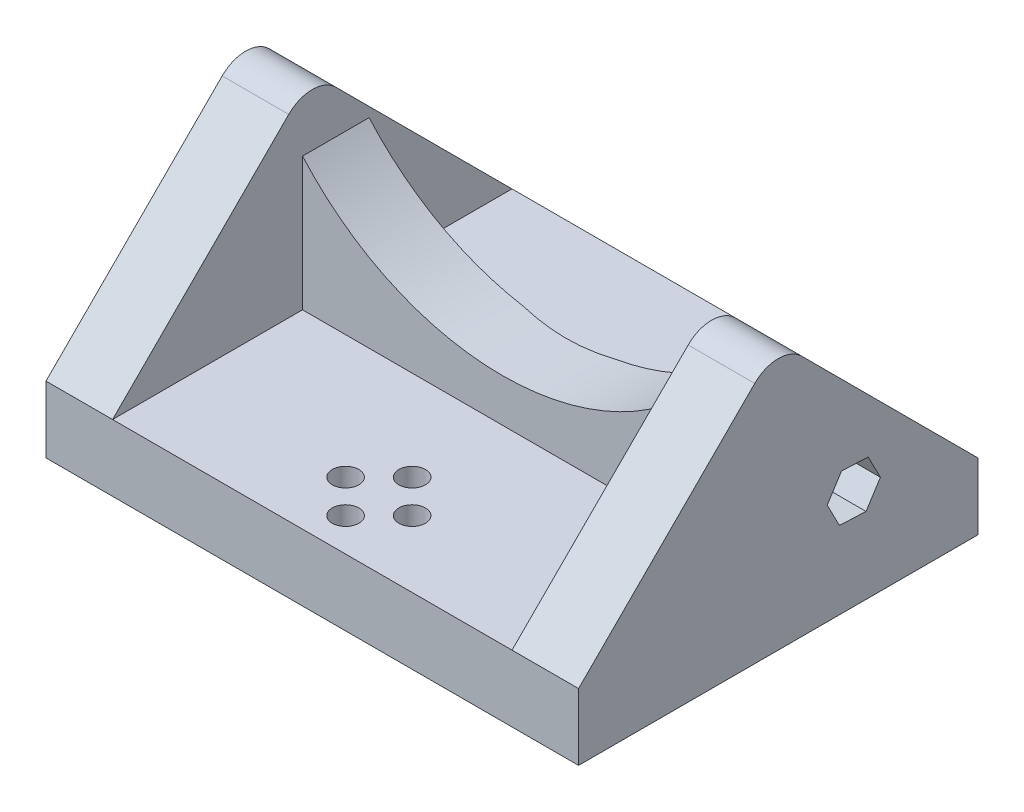
ISO-10303-21;
HEADER;
FILE_DESCRIPTION(('STEP AP214'),'2;1');
FILE_NAME('part.step','',(''),(''),'','','');
FILE_SCHEMA(('AUTOMOTIVE_DESIGN { 1 0 10303 214 1 1 1 1 }'));
ENDSEC;
DATA;
#1=APPLICATION_CONTEXT('core data for automotive mechanical design processes');
#2=APPLICATION_PROTOCOL_DEFINITION('international standard','automotive_design',2000,#1);
#3=PRODUCT_CONTEXT('',#1,'mechanical');
#4=PRODUCT('Part','Part','',(#3));
#5=PRODUCT_RELATED_PRODUCT_CATEGORY('part','',(#4));
#6=PRODUCT_DEFINITION_FORMATION('','',#4);
#7=PRODUCT_DEFINITION_CONTEXT('part definition',#1,'design');
#8=PRODUCT_DEFINITION('design','',#6,#7);
#9=PRODUCT_DEFINITION_SHAPE('','',#8);
#10=(LENGTH_UNIT() NAMED_UNIT(*) SI_UNIT(.MILLI.,.METRE.));
#11=(NAMED_UNIT(*) PLANE_ANGLE_UNIT() SI_UNIT($,.RADIAN.));
#12=(NAMED_UNIT(*) SI_UNIT($,.STERADIAN.) SOLID_ANGLE_UNIT());
#13=UNCERTAINTY_MEASURE_WITH_UNIT(LENGTH_MEASURE(1.E-05),#10,'distance_accuracy_value','');
#14=(GEOMETRIC_REPRESENTATION_CONTEXT(3) GLOBAL_UNCERTAINTY_ASSIGNED_CONTEXT((#13)) GLOBAL_UNIT_ASSIGNED_CONTEXT((#10,
#11,#12)) REPRESENTATION_CONTEXT('',''));
#15=CARTESIAN_POINT('',(0.,0.,0.));
#16=DIRECTION('',(0.,0.,1.));
#17=DIRECTION('',(1.,0.,0.));
#18=AXIS2_PLACEMENT_3D('',#15,#16,#17);
#19=CARTESIAN_POINT('',(-40.,56.4575131106459,-38.5355339059327));
#20=DIRECTION('',(0.,0.,1.));
#21=DIRECTION('',(1.,0.,0.));
#22=AXIS2_PLACEMENT_3D('',#19,#20,#21);
#23=PLANE('',#22);
#24=DIRECTION('',(0.,-1.,0.));
#25=VECTOR('',#24,1.);
#26=CARTESIAN_POINT('',(-70.,30.,-38.5355339059327));
#27=LINE('',#26,#25);
#28=CARTESIAN_POINT('',(-70.,12.8888136877048,-38.5355339059327));
#29=VERTEX_POINT('',#28);
#30=CARTESIAN_POINT('',(-70.,10.,-38.5355339059327));
#31=VERTEX_POINT('',#30);
#32=EDGE_CURVE('E392',#29,#31,#27,.T.);
#33=ORIENTED_EDGE('',*,*,#32,.F.);
#34=DIRECTION('',(1.,0.,0.));
#35=VECTOR('',#34,1.);
#36=CARTESIAN_POINT('',(-40.,12.8888136877048,-38.5355339059327));
#37=LINE('',#36,#35);
#38=CARTESIAN_POINT('',(-10.,12.8888136877048,-38.5355339059327));
#39=VERTEX_POINT('',#38);
#40=EDGE_CURVE('E527',#29,#39,#37,.T.);
#41=ORIENTED_EDGE('',*,*,#40,.T.);
#42=DIRECTION('',(0.,1.,0.));
#43=VECTOR('',#42,1.);
#44=CARTESIAN_POINT('',(-10.,10.,-38.5355339059327));
#45=LINE('',#44,#43);
#46=CARTESIAN_POINT('',(-10.,10.,-38.5355339059327));
#47=VERTEX_POINT('',#46);
#48=EDGE_CURVE('E375',#47,#39,#45,.T.);
#49=ORIENTED_EDGE('',*,*,#48,.F.);
#50=DIRECTION('',(1.,0.,0.));
#51=VECTOR('',#50,1.);
#52=CARTESIAN_POINT('',(-70.,10.,-38.5355339059327));
#53=LINE('',#52,#51);
#54=EDGE_CURVE('E397',#31,#47,#53,.T.);
#55=ORIENTED_EDGE('',*,*,#54,.F.);
#56=EDGE_LOOP('',(#33,#41,#49,#55));
#57=FACE_BOUND('',#56,.T.);
#58=ADVANCED_FACE('F39',(#57),#23,.F.);
#59=CARTESIAN_POINT('',(-10.,17.0398730154495,-38.5355339059327));
#60=VERTEX_POINT('',#59);
#61=CARTESIAN_POINT('',(-10.,30.,-38.5355339059327));
#62=VERTEX_POINT('',#61);
#63=EDGE_CURVE('E400',#60,#62,#45,.T.);
#64=ORIENTED_EDGE('',*,*,#63,.F.);
#65=DIRECTION('',(-1.,0.,0.));
#66=VECTOR('',#65,1.);
#67=CARTESIAN_POINT('',(-40.,17.0398730154495,-38.5355339059327));
#68=LINE('',#67,#66);
#69=CARTESIAN_POINT('',(-33.1992905277785,17.0398730154495,-38.5355339059327));
#70=VERTEX_POINT('',#69);
#71=EDGE_CURVE('E526',#60,#70,#68,.T.);
#72=ORIENTED_EDGE('',*,*,#71,.T.);
#73=CARTESIAN_POINT('',(-40.,56.4575131106459,-38.5355339059327));
#74=DIRECTION('',(0.,0.,-1.));
#75=DIRECTION('',(1.,0.,0.));
#76=AXIS2_PLACEMENT_3D('',#73,#74,#75);
#77=CIRCLE('',#76,40.);
#78=EDGE_CURVE('E388',#62,#70,#77,.T.);
#79=ORIENTED_EDGE('',*,*,#78,.F.);
#80=EDGE_LOOP('',(#64,#72,#79));
#81=FACE_BOUND('',#80,.T.);
#82=ADVANCED_FACE('F568',(#81),#23,.F.);
#83=CARTESIAN_POINT('',(0.,10.,0.));
#84=DIRECTION('',(0.,1.,0.));
#85=DIRECTION('',(0.,0.,1.));
#86=AXIS2_PLACEMENT_3D('',#83,#84,#85);
#87=PLANE('',#86);
#88=DIRECTION('',(0.,0.,-1.));
#89=VECTOR('',#88,1.);
#90=CARTESIAN_POINT('',(-70.,10.,-60.));
#91=LINE('',#90,#89);
#92=CARTESIAN_POINT('',(-70.,10.,-60.));
#93=VERTEX_POINT('',#92);
#94=EDGE_CURVE('E411',#31,#93,#91,.T.);
#95=ORIENTED_EDGE('',*,*,#94,.F.);
#96=ORIENTED_EDGE('',*,*,#54,.T.);
#97=DIRECTION('',(0.,0.,-1.));
#98=VECTOR('',#97,1.);
#99=CARTESIAN_POINT('',(-10.,10.,-60.));
#100=LINE('',#99,#98);
#101=CARTESIAN_POINT('',(-10.,10.,-60.));
#102=VERTEX_POINT('',#101);
#103=EDGE_CURVE('E440',#47,#102,#100,.T.);
#104=ORIENTED_EDGE('',*,*,#103,.T.);
#105=DIRECTION('',(-1.,0.,0.));
#106=VECTOR('',#105,1.);
#107=CARTESIAN_POINT('',(0.,10.,-60.));
#108=LINE('',#107,#106);
#109=EDGE_CURVE('E463',#102,#93,#108,.T.);
#110=ORIENTED_EDGE('',*,*,#109,.T.);
#111=EDGE_LOOP('',(#95,#96,#104,#110));
#112=FACE_BOUND('',#111,.T.);
#113=ADVANCED_FACE('F575',(#112),#87,.T.);
#114=CARTESIAN_POINT('',(-40.,10.,-15.));
#115=DIRECTION('',(0.,1.,0.));
#116=DIRECTION('',(0.,0.,1.));
#117=AXIS2_PLACEMENT_3D('',#114,#115,#116);
#118=CIRCLE('',#117,2.);
#119=CARTESIAN_POINT('',(-40.,10.,-13.));
#120=VERTEX_POINT('',#119);
#121=EDGE_CURVE('E343',#120,#120,#118,.T.);
#122=ORIENTED_EDGE('',*,*,#121,.F.);
#123=EDGE_LOOP('',(#122));
#124=FACE_BOUND('',#123,.T.);
#125=CARTESIAN_POINT('',(-34.9999999999999,10.,-10.0000000000001));
#126=DIRECTION('',(0.,1.,0.));
#127=DIRECTION('',(0.,0.,1.));
#128=AXIS2_PLACEMENT_3D('',#125,#126,#127);
#129=CIRCLE('',#128,2.);
#130=CARTESIAN_POINT('',(-34.9999999999999,10.,-8.00000000000011));
#131=VERTEX_POINT('',#130);
#132=EDGE_CURVE('E351',#131,#131,#129,.T.);
#133=ORIENTED_EDGE('',*,*,#132,.F.);
#134=EDGE_LOOP('',(#133));
#135=FACE_BOUND('',#134,.T.);
#136=CARTESIAN_POINT('',(-39.9999999999998,10.,-5.));
#137=DIRECTION('',(0.,1.,0.));
#138=DIRECTION('',(0.,0.,1.));
#139=AXIS2_PLACEMENT_3D('',#136,#137,#138);
#140=CIRCLE('',#139,2.00000000000001);
#141=CARTESIAN_POINT('',(-39.9999999999998,10.,-2.99999999999999));
#142=VERTEX_POINT('',#141);
#143=EDGE_CURVE('E359',#142,#142,#140,.T.);
#144=ORIENTED_EDGE('',*,*,#143,.F.);
#145=EDGE_LOOP('',(#144));
#146=FACE_BOUND('',#145,.T.);
#147=CARTESIAN_POINT('',(-44.9999999999999,10.,-9.99999999999991));
#148=DIRECTION('',(0.,1.,0.));
#149=DIRECTION('',(0.,0.,1.));
#150=AXIS2_PLACEMENT_3D('',#147,#148,#149);
#151=CIRCLE('',#150,2.);
#152=CARTESIAN_POINT('',(-44.9999999999999,10.,-7.99999999999991));
#153=VERTEX_POINT('',#152);
#154=EDGE_CURVE('E337',#153,#153,#151,.T.);
#155=ORIENTED_EDGE('',*,*,#154,.F.);
#156=EDGE_LOOP('',(#155));
#157=FACE_BOUND('',#156,.T.);
#158=DIRECTION('',(1.,0.,0.));
#159=VECTOR('',#158,1.);
#160=CARTESIAN_POINT('',(-70.,10.,-28.5355339059327));
#161=LINE('',#160,#159);
#162=CARTESIAN_POINT('',(-70.,10.,-28.5355339059327));
#163=VERTEX_POINT('',#162);
#164=CARTESIAN_POINT('',(-10.,10.,-28.5355339059327));
#165=VERTEX_POINT('',#164);
#166=EDGE_CURVE('E379',#163,#165,#161,.T.);
#167=ORIENTED_EDGE('',*,*,#166,.F.);
#168=CARTESIAN_POINT('',(-70.,10.,0.));
#169=VERTEX_POINT('',#168);
#170=EDGE_CURVE('E421',#169,#163,#91,.T.);
#171=ORIENTED_EDGE('',*,*,#170,.F.);
#172=DIRECTION('',(1.,0.,0.));
#173=VECTOR('',#172,1.);
#174=CARTESIAN_POINT('',(0.,10.,0.));
#175=LINE('',#174,#173);
#176=CARTESIAN_POINT('',(-10.,10.,0.));
#177=VERTEX_POINT('',#176);
#178=EDGE_CURVE('E462',#169,#177,#175,.T.);
#179=ORIENTED_EDGE('',*,*,#178,.T.);
#180=EDGE_CURVE('E435',#177,#165,#100,.T.);
#181=ORIENTED_EDGE('',*,*,#180,.T.);
#182=EDGE_LOOP('',(#167,#171,#179,#181));
#183=FACE_BOUND('',#182,.T.);
#184=ADVANCED_FACE('F661',(#124,#135,#146,#157,#183),#87,.T.);
#185=CARTESIAN_POINT('',(0.,10.,0.));
#186=DIRECTION('',(-1.,0.,0.));
#187=DIRECTION('',(0.,0.,1.));
#188=AXIS2_PLACEMENT_3D('',#185,#186,#187);
#189=PLANE('',#188);
#190=DIRECTION('',(0.,0.842523623940514,-0.538659394332024));
#191=VECTOR('',#190,1.);
#192=CARTESIAN_POINT('',(0.,11.4489818742044,-43.1842073473229));
#193=LINE('',#192,#191);
#194=CARTESIAN_POINT('',(0.,11.4489818742044,-43.184207347323));
#195=VERTEX_POINT('',#194);
#196=CARTESIAN_POINT('',(0.,14.8190763699663,-45.338844924651));
#197=VERTEX_POINT('',#196);
#198=EDGE_CURVE('E273',#195,#197,#193,.T.);
#199=ORIENTED_EDGE('',*,*,#198,.F.);
#200=DIRECTION('',(0.,-0.0452309075084053,-0.998976558787025));
#201=VECTOR('',#200,1.);
#202=CARTESIAN_POINT('',(0.,11.629905504238,-39.1883011121748));
#203=LINE('',#202,#201);
#204=CARTESIAN_POINT('',(0.,11.629905504238,-39.1883011121748));
#205=VERTEX_POINT('',#204);
#206=EDGE_CURVE('E55',#205,#195,#203,.T.);
#207=ORIENTED_EDGE('',*,*,#206,.F.);
#208=DIRECTION('',(0.,-0.887754531448925,-0.460317164455008));
#209=VECTOR('',#208,1.);
#210=CARTESIAN_POINT('',(0.,15.1809236300336,-37.3470324543548));
#211=LINE('',#210,#209);
#212=CARTESIAN_POINT('',(0.,15.1809236300336,-37.3470324543548));
#213=VERTEX_POINT('',#212);
#214=EDGE_CURVE('E253',#213,#205,#211,.T.);
#215=ORIENTED_EDGE('',*,*,#214,.F.);
#216=DIRECTION('',(0.,-0.842523623940514,0.538659394332024));
#217=VECTOR('',#216,1.);
#218=CARTESIAN_POINT('',(0.,18.5510181257957,-39.5016700316829));
#219=LINE('',#218,#217);
#220=CARTESIAN_POINT('',(0.,18.5510181257957,-39.5016700316829));
#221=VERTEX_POINT('',#220);
#222=EDGE_CURVE('E257',#221,#213,#219,.T.);
#223=ORIENTED_EDGE('',*,*,#222,.F.);
#224=DIRECTION('',(0.,0.0452309075084055,0.998976558787025));
#225=VECTOR('',#224,1.);
#226=CARTESIAN_POINT('',(0.,18.3700944957621,-43.497576266831));
#227=LINE('',#226,#225);
#228=CARTESIAN_POINT('',(0.,18.3700944957621,-43.497576266831));
#229=VERTEX_POINT('',#228);
#230=EDGE_CURVE('E281',#229,#221,#227,.T.);
#231=ORIENTED_EDGE('',*,*,#230,.F.);
#232=DIRECTION('',(0.,0.887754531448932,0.460317164454995));
#233=VECTOR('',#232,1.);
#234=CARTESIAN_POINT('',(0.,14.8190763699663,-45.338844924651));
#235=LINE('',#234,#233);
#236=EDGE_CURVE('E277',#197,#229,#235,.T.);
#237=ORIENTED_EDGE('',*,*,#236,.F.);
#238=EDGE_LOOP('',(#199,#207,#215,#223,#231,#237));
#239=FACE_BOUND('',#238,.T.);
#240=DIRECTION('',(0.,0.707106781186544,0.707106781186551));
#241=VECTOR('',#240,1.);
#242=CARTESIAN_POINT('',(0.,39.9999999999997,-30.));
#243=LINE('',#242,#241);
#244=CARTESIAN_POINT('',(0.,10.,-60.));
#245=VERTEX_POINT('',#244);
#246=CARTESIAN_POINT('',(0.,36.464466094067,-33.5355339059327));
#247=VERTEX_POINT('',#246);
#248=EDGE_CURVE('E434',#245,#247,#243,.T.);
#249=ORIENTED_EDGE('',*,*,#248,.T.);
#250=CARTESIAN_POINT('',(0.,32.9289321881343,-30.));
#251=DIRECTION('',(-1.,0.,0.));
#252=DIRECTION('',(0.,0.,1.));
#253=AXIS2_PLACEMENT_3D('',#250,#251,#252);
#254=CIRCLE('',#253,5.);
#255=CARTESIAN_POINT('',(0.,36.464466094067,-26.4644660940673));
#256=VERTEX_POINT('',#255);
#257=EDGE_CURVE('E500',#247,#256,#254,.F.);
#258=ORIENTED_EDGE('',*,*,#257,.T.);
#259=DIRECTION('',(0.,-0.707106781186544,0.707106781186551));
#260=VECTOR('',#259,1.);
#261=CARTESIAN_POINT('',(0.,10.,0.));
#262=LINE('',#261,#260);
#263=CARTESIAN_POINT('',(0.,10.,0.));
#264=VERTEX_POINT('',#263);
#265=EDGE_CURVE('E451',#256,#264,#262,.T.);
#266=ORIENTED_EDGE('',*,*,#265,.T.);
#267=DIRECTION('',(0.,-1.,0.));
#268=VECTOR('',#267,1.);
#269=CARTESIAN_POINT('',(0.,10.,0.));
#270=LINE('',#269,#268);
#271=CARTESIAN_POINT('',(0.,0.,0.));
#272=VERTEX_POINT('',#271);
#273=EDGE_CURVE('E468',#264,#272,#270,.T.);
#274=ORIENTED_EDGE('',*,*,#273,.T.);
#275=DIRECTION('',(0.,0.,-1.));
#276=VECTOR('',#275,1.);
#277=CARTESIAN_POINT('',(0.,0.,0.));
#278=LINE('',#277,#276);
#279=CARTESIAN_POINT('',(0.,0.,-60.));
#280=VERTEX_POINT('',#279);
#281=EDGE_CURVE('E457',#272,#280,#278,.T.);
#282=ORIENTED_EDGE('',*,*,#281,.T.);
#283=DIRECTION('',(0.,-1.,0.));
#284=VECTOR('',#283,1.);
#285=CARTESIAN_POINT('',(0.,10.,-60.));
#286=LINE('',#285,#284);
#287=EDGE_CURVE('E492',#245,#280,#286,.T.);
#288=ORIENTED_EDGE('',*,*,#287,.F.);
#289=EDGE_LOOP('',(#249,#258,#266,#274,#282,#288));
#290=FACE_BOUND('',#289,.T.);
#291=ADVANCED_FACE('F610',(#239,#290),#189,.F.);
#292=CARTESIAN_POINT('',(0.,10.,-60.));
#293=DIRECTION('',(0.,0.,1.));
#294=DIRECTION('',(1.,0.,0.));
#295=AXIS2_PLACEMENT_3D('',#292,#293,#294);
#296=PLANE('',#295);
#297=DIRECTION('',(-1.,0.,0.));
#298=VECTOR('',#297,1.);
#299=CARTESIAN_POINT('',(0.,0.,-60.));
#300=LINE('',#299,#298);
#301=CARTESIAN_POINT('',(-80.,0.,-60.));
#302=VERTEX_POINT('',#301);
#303=EDGE_CURVE('E472',#280,#302,#300,.T.);
#304=ORIENTED_EDGE('',*,*,#303,.T.);
#305=DIRECTION('',(0.,-1.,0.));
#306=VECTOR('',#305,1.);
#307=CARTESIAN_POINT('',(-80.,10.,-60.));
#308=LINE('',#307,#306);
#309=CARTESIAN_POINT('',(-80.,10.,-60.));
#310=VERTEX_POINT('',#309);
#311=EDGE_CURVE('E488',#310,#302,#308,.T.);
#312=ORIENTED_EDGE('',*,*,#311,.F.);
#313=DIRECTION('',(1.,0.,0.));
#314=VECTOR('',#313,1.);
#315=CARTESIAN_POINT('',(-80.,10.,-60.));
#316=LINE('',#315,#314);
#317=EDGE_CURVE('E420',#310,#93,#316,.T.);
#318=ORIENTED_EDGE('',*,*,#317,.T.);
#319=ORIENTED_EDGE('',*,*,#109,.F.);
#320=EDGE_CURVE('E458',#245,#102,#108,.T.);
#321=ORIENTED_EDGE('',*,*,#320,.F.);
#322=ORIENTED_EDGE('',*,*,#287,.T.);
#323=EDGE_LOOP('',(#304,#312,#318,#319,#321,#322));
#324=FACE_BOUND('',#323,.T.);
#325=ADVANCED_FACE('F697',(#324),#296,.F.);
#326=CARTESIAN_POINT('',(-80.,10.,0.));
#327=DIRECTION('',(1.,0.,0.));
#328=DIRECTION('',(0.,0.,-1.));
#329=AXIS2_PLACEMENT_3D('',#326,#327,#328);
#330=PLANE('',#329);
#331=DIRECTION('',(0.,-0.887754531448925,-0.460317164455008));
#332=VECTOR('',#331,1.);
#333=CARTESIAN_POINT('',(-80.,15.1809236300336,-37.3470324543548));
#334=LINE('',#333,#332);
#335=CARTESIAN_POINT('',(-80.,15.1809236300336,-37.3470324543548));
#336=VERTEX_POINT('',#335);
#337=CARTESIAN_POINT('',(-80.,11.629905504238,-39.1883011121748));
#338=VERTEX_POINT('',#337);
#339=EDGE_CURVE('E251',#336,#338,#334,.T.);
#340=ORIENTED_EDGE('',*,*,#339,.T.);
#341=DIRECTION('',(0.,-0.0452309075084053,-0.998976558787025));
#342=VECTOR('',#341,1.);
#343=CARTESIAN_POINT('',(-80.,11.629905504238,-39.1883011121748));
#344=LINE('',#343,#342);
#345=CARTESIAN_POINT('',(-80.,11.4489818742044,-43.1842073473229));
#346=VERTEX_POINT('',#345);
#347=EDGE_CURVE('E232',#338,#346,#344,.T.);
#348=ORIENTED_EDGE('',*,*,#347,.T.);
#349=DIRECTION('',(0.,0.842523623940514,-0.538659394332024));
#350=VECTOR('',#349,1.);
#351=CARTESIAN_POINT('',(-80.,11.4489818742044,-43.1842073473229));
#352=LINE('',#351,#350);
#353=CARTESIAN_POINT('',(-80.,14.8190763699663,-45.338844924651));
#354=VERTEX_POINT('',#353);
#355=EDGE_CURVE('E241',#346,#354,#352,.T.);
#356=ORIENTED_EDGE('',*,*,#355,.T.);
#357=DIRECTION('',(0.,0.887754531448932,0.460317164454995));
#358=VECTOR('',#357,1.);
#359=CARTESIAN_POINT('',(-80.,14.8190763699663,-45.338844924651));
#360=LINE('',#359,#358);
#361=CARTESIAN_POINT('',(-80.,18.3700944957621,-43.497576266831));
#362=VERTEX_POINT('',#361);
#363=EDGE_CURVE('E63',#354,#362,#360,.T.);
#364=ORIENTED_EDGE('',*,*,#363,.T.);
#365=DIRECTION('',(0.,0.0452309075084055,0.998976558787025));
#366=VECTOR('',#365,1.);
#367=CARTESIAN_POINT('',(-80.,18.3700944957621,-43.497576266831));
#368=LINE('',#367,#366);
#369=CARTESIAN_POINT('',(-80.,18.5510181257957,-39.5016700316829));
#370=VERTEX_POINT('',#369);
#371=EDGE_CURVE('E262',#362,#370,#368,.T.);
#372=ORIENTED_EDGE('',*,*,#371,.T.);
#373=DIRECTION('',(0.,-0.842523623940514,0.538659394332024));
#374=VECTOR('',#373,1.);
#375=CARTESIAN_POINT('',(-80.,18.5510181257957,-39.5016700316829));
#376=LINE('',#375,#374);
#377=EDGE_CURVE('E266',#370,#336,#376,.T.);
#378=ORIENTED_EDGE('',*,*,#377,.T.);
#379=EDGE_LOOP('',(#340,#348,#356,#364,#372,#378));
#380=FACE_BOUND('',#379,.T.);
#381=DIRECTION('',(0.,-0.707106781186544,0.707106781186551));
#382=VECTOR('',#381,1.);
#383=CARTESIAN_POINT('',(-80.,10.,0.));
#384=LINE('',#383,#382);
#385=CARTESIAN_POINT('',(-80.,36.464466094067,-26.4644660940673));
#386=VERTEX_POINT('',#385);
#387=CARTESIAN_POINT('',(-80.,10.,0.));
#388=VERTEX_POINT('',#387);
#389=EDGE_CURVE('E416',#386,#388,#384,.T.);
#390=ORIENTED_EDGE('',*,*,#389,.F.);
#391=CARTESIAN_POINT('',(-80.,32.9289321881343,-30.));
#392=DIRECTION('',(1.,0.,0.));
#393=DIRECTION('',(0.,0.,-1.));
#394=AXIS2_PLACEMENT_3D('',#391,#392,#393);
#395=CIRCLE('',#394,5.);
#396=CARTESIAN_POINT('',(-80.,36.464466094067,-33.5355339059327));
#397=VERTEX_POINT('',#396);
#398=EDGE_CURVE('E519',#386,#397,#395,.F.);
#399=ORIENTED_EDGE('',*,*,#398,.T.);
#400=DIRECTION('',(0.,0.707106781186544,0.707106781186551));
#401=VECTOR('',#400,1.);
#402=CARTESIAN_POINT('',(-80.,39.9999999999997,-30.));
#403=LINE('',#402,#401);
#404=EDGE_CURVE('E412',#310,#397,#403,.T.);
#405=ORIENTED_EDGE('',*,*,#404,.F.);
#406=ORIENTED_EDGE('',*,*,#311,.T.);
#407=DIRECTION('',(0.,0.,1.));
#408=VECTOR('',#407,1.);
#409=CARTESIAN_POINT('',(-80.,0.,0.));
#410=LINE('',#409,#408);
#411=CARTESIAN_POINT('',(-80.,0.,0.));
#412=VERTEX_POINT('',#411);
#413=EDGE_CURVE('E475',#302,#412,#410,.T.);
#414=ORIENTED_EDGE('',*,*,#413,.T.);
#415=DIRECTION('',(0.,-1.,0.));
#416=VECTOR('',#415,1.);
#417=CARTESIAN_POINT('',(-80.,10.,0.));
#418=LINE('',#417,#416);
#419=EDGE_CURVE('E484',#388,#412,#418,.T.);
#420=ORIENTED_EDGE('',*,*,#419,.F.);
#421=EDGE_LOOP('',(#390,#399,#405,#406,#414,#420));
#422=FACE_BOUND('',#421,.T.);
#423=ADVANCED_FACE('F247',(#380,#422),#330,.F.);
#424=CARTESIAN_POINT('',(0.,10.,0.));
#425=DIRECTION('',(0.,0.,-1.));
#426=DIRECTION('',(-1.,0.,0.));
#427=AXIS2_PLACEMENT_3D('',#424,#425,#426);
#428=PLANE('',#427);
#429=DIRECTION('',(1.,0.,0.));
#430=VECTOR('',#429,1.);
#431=CARTESIAN_POINT('',(0.,0.,0.));
#432=LINE('',#431,#430);
#433=EDGE_CURVE('E478',#412,#272,#432,.T.);
#434=ORIENTED_EDGE('',*,*,#433,.T.);
#435=ORIENTED_EDGE('',*,*,#273,.F.);
#436=DIRECTION('',(1.,0.,0.));
#437=VECTOR('',#436,1.);
#438=CARTESIAN_POINT('',(-10.,10.,0.));
#439=LINE('',#438,#437);
#440=EDGE_CURVE('E447',#177,#264,#439,.T.);
#441=ORIENTED_EDGE('',*,*,#440,.F.);
#442=ORIENTED_EDGE('',*,*,#178,.F.);
#443=EDGE_CURVE('E464',#388,#169,#175,.T.);
#444=ORIENTED_EDGE('',*,*,#443,.F.);
#445=ORIENTED_EDGE('',*,*,#419,.T.);
#446=EDGE_LOOP('',(#434,#435,#441,#442,#444,#445));
#447=FACE_BOUND('',#446,.T.);
#448=ADVANCED_FACE('F653',(#447),#428,.F.);
#449=CARTESIAN_POINT('',(0.,0.,0.));
#450=DIRECTION('',(0.,1.,0.));
#451=DIRECTION('',(0.,0.,1.));
#452=AXIS2_PLACEMENT_3D('',#449,#450,#451);
#453=PLANE('',#452);
#454=CARTESIAN_POINT('',(-40.,0.,-15.));
#455=DIRECTION('',(0.,1.,0.));
#456=DIRECTION('',(0.,0.,1.));
#457=AXIS2_PLACEMENT_3D('',#454,#455,#456);
#458=CIRCLE('',#457,2.);
#459=CARTESIAN_POINT('',(-40.,0.,-13.));
#460=VERTEX_POINT('',#459);
#461=EDGE_CURVE('E338',#460,#460,#458,.T.);
#462=ORIENTED_EDGE('',*,*,#461,.T.);
#463=EDGE_LOOP('',(#462));
#464=FACE_BOUND('',#463,.T.);
#465=CARTESIAN_POINT('',(-34.9999999999999,0.,-10.0000000000001));
#466=DIRECTION('',(0.,1.,0.));
#467=DIRECTION('',(0.,0.,1.));
#468=AXIS2_PLACEMENT_3D('',#465,#466,#467);
#469=CIRCLE('',#468,2.);
#470=CARTESIAN_POINT('',(-34.9999999999999,0.,-8.00000000000011));
#471=VERTEX_POINT('',#470);
#472=EDGE_CURVE('E347',#471,#471,#469,.T.);
#473=ORIENTED_EDGE('',*,*,#472,.T.);
#474=EDGE_LOOP('',(#473));
#475=FACE_BOUND('',#474,.T.);
#476=CARTESIAN_POINT('',(-39.9999999999998,0.,-5.));
#477=DIRECTION('',(0.,1.,0.));
#478=DIRECTION('',(0.,0.,1.));
#479=AXIS2_PLACEMENT_3D('',#476,#477,#478);
#480=CIRCLE('',#479,2.00000000000001);
#481=CARTESIAN_POINT('',(-39.9999999999998,0.,-2.99999999999999));
#482=VERTEX_POINT('',#481);
#483=EDGE_CURVE('E355',#482,#482,#480,.T.);
#484=ORIENTED_EDGE('',*,*,#483,.T.);
#485=EDGE_LOOP('',(#484));
#486=FACE_BOUND('',#485,.T.);
#487=CARTESIAN_POINT('',(-44.9999999999999,0.,-9.99999999999991));
#488=DIRECTION('',(0.,1.,0.));
#489=DIRECTION('',(0.,0.,1.));
#490=AXIS2_PLACEMENT_3D('',#487,#488,#489);
#491=CIRCLE('',#490,2.);
#492=CARTESIAN_POINT('',(-44.9999999999999,0.,-7.99999999999991));
#493=VERTEX_POINT('',#492);
#494=EDGE_CURVE('E363',#493,#493,#491,.T.);
#495=ORIENTED_EDGE('',*,*,#494,.T.);
#496=EDGE_LOOP('',(#495));
#497=FACE_BOUND('',#496,.T.);
#498=ORIENTED_EDGE('',*,*,#281,.F.);
#499=ORIENTED_EDGE('',*,*,#433,.F.);
#500=ORIENTED_EDGE('',*,*,#413,.F.);
#501=ORIENTED_EDGE('',*,*,#303,.F.);
#502=EDGE_LOOP('',(#498,#499,#500,#501));
#503=FACE_BOUND('',#502,.T.);
#504=ADVANCED_FACE('F682',(#464,#475,#486,#497,#503),#453,.F.);
#505=CARTESIAN_POINT('',(-10.,10.,0.));
#506=DIRECTION('',(0.,0.707106781186551,0.707106781186544));
#507=DIRECTION('',(0.,-0.707106781186544,0.707106781186551));
#508=AXIS2_PLACEMENT_3D('',#505,#506,#507);
#509=PLANE('',#508);
#510=ORIENTED_EDGE('',*,*,#265,.F.);
#511=DIRECTION('',(1.,0.,0.));
#512=VECTOR('',#511,1.);
#513=CARTESIAN_POINT('',(-10.,36.464466094067,-26.4644660940673));
#514=LINE('',#513,#512);
#515=CARTESIAN_POINT('',(-10.,36.464466094067,-26.4644660940673));
#516=VERTEX_POINT('',#515);
#517=EDGE_CURVE('E503',#256,#516,#514,.F.);
#518=ORIENTED_EDGE('',*,*,#517,.T.);
#519=DIRECTION('',(0.,-0.707106781186544,0.707106781186551));
#520=VECTOR('',#519,1.);
#521=CARTESIAN_POINT('',(-10.,10.,0.));
#522=LINE('',#521,#520);
#523=EDGE_CURVE('E444',#516,#177,#522,.T.);
#524=ORIENTED_EDGE('',*,*,#523,.T.);
#525=ORIENTED_EDGE('',*,*,#440,.T.);
#526=EDGE_LOOP('',(#510,#518,#524,#525));
#527=FACE_BOUND('',#526,.T.);
#528=ADVANCED_FACE('F679',(#527),#509,.T.);
#529=CARTESIAN_POINT('',(-10.,39.9999999999997,-30.));
#530=DIRECTION('',(0.,0.707106781186551,-0.707106781186544));
#531=DIRECTION('',(0.,0.707106781186544,0.707106781186551));
#532=AXIS2_PLACEMENT_3D('',#529,#530,#531);
#533=PLANE('',#532);
#534=DIRECTION('',(0.,0.707106781186544,0.707106781186551));
#535=VECTOR('',#534,1.);
#536=CARTESIAN_POINT('',(-10.,39.9999999999997,-30.));
#537=LINE('',#536,#535);
#538=CARTESIAN_POINT('',(-10.,36.464466094067,-33.5355339059327));
#539=VERTEX_POINT('',#538);
#540=EDGE_CURVE('E439',#102,#539,#537,.T.);
#541=ORIENTED_EDGE('',*,*,#540,.T.);
#542=DIRECTION('',(1.,0.,0.));
#543=VECTOR('',#542,1.);
#544=CARTESIAN_POINT('',(-10.,36.464466094067,-33.5355339059327));
#545=LINE('',#544,#543);
#546=EDGE_CURVE('E496',#539,#247,#545,.T.);
#547=ORIENTED_EDGE('',*,*,#546,.T.);
#548=ORIENTED_EDGE('',*,*,#248,.F.);
#549=ORIENTED_EDGE('',*,*,#320,.T.);
#550=EDGE_LOOP('',(#541,#547,#548,#549));
#551=FACE_BOUND('',#550,.T.);
#552=ADVANCED_FACE('F678',(#551),#533,.T.);
#553=CARTESIAN_POINT('',(-10.,0.,0.));
#554=DIRECTION('',(-1.,0.,0.));
#555=DIRECTION('',(0.,0.,1.));
#556=AXIS2_PLACEMENT_3D('',#553,#554,#555);
#557=PLANE('',#556);
#558=DIRECTION('',(0.,0.887754531448925,0.460317164455008));
#559=VECTOR('',#558,1.);
#560=CARTESIAN_POINT('',(-10.,18.4785289721438,-35.6371630177051));
#561=LINE('',#560,#559);
#562=CARTESIAN_POINT('',(-9.99999999999999,11.629905504238,-39.1883011121748));
#563=VERTEX_POINT('',#562);
#564=EDGE_CURVE('E322',#563,#39,#561,.T.);
#565=ORIENTED_EDGE('',*,*,#564,.F.);
#566=DIRECTION('',(0.,0.0452309075084053,0.998976558787025));
#567=VECTOR('',#566,1.);
#568=CARTESIAN_POINT('',(-10.,13.3768209870978,-0.605665615976587));
#569=LINE('',#568,#567);
#570=CARTESIAN_POINT('',(-9.99999999999999,11.4489818742044,-43.1842073473229));
#571=VERTEX_POINT('',#570);
#572=EDGE_CURVE('E334',#571,#563,#569,.T.);
#573=ORIENTED_EDGE('',*,*,#572,.F.);
#574=DIRECTION('',(0.,-0.842523623940514,0.538659394332024));
#575=VECTOR('',#574,1.);
#576=CARTESIAN_POINT('',(-10.,-16.2764625807994,-25.4582104810643));
#577=LINE('',#576,#575);
#578=CARTESIAN_POINT('',(-9.99999999999999,14.8190763699663,-45.338844924651));
#579=VERTEX_POINT('',#578);
#580=EDGE_CURVE('E325',#579,#571,#577,.T.);
#581=ORIENTED_EDGE('',*,*,#580,.F.);
#582=DIRECTION('',(0.,-0.887754531448933,-0.460317164454995));
#583=VECTOR('',#582,1.);
#584=CARTESIAN_POINT('',(-10.,21.6676998378716,-41.7877068301816));
#585=LINE('',#584,#583);
#586=CARTESIAN_POINT('',(-9.99999999999999,18.3700944957621,-43.497576266831));
#587=VERTEX_POINT('',#586);
#588=EDGE_CURVE('E328',#587,#579,#585,.T.);
#589=ORIENTED_EDGE('',*,*,#588,.F.);
#590=DIRECTION('',(0.,-0.0452309075084055,-0.998976558787025));
#591=VECTOR('',#590,1.);
#592=CARTESIAN_POINT('',(-10.,20.2979336086555,-0.919034535484614));
#593=LINE('',#592,#591);
#594=CARTESIAN_POINT('',(-9.99999999999999,18.5510181257957,-39.5016700316829));
#595=VERTEX_POINT('',#594);
#596=EDGE_CURVE('E331',#595,#587,#593,.T.);
#597=ORIENTED_EDGE('',*,*,#596,.F.);
#598=DIRECTION('',(0.,0.842523623940514,-0.538659394332024));
#599=VECTOR('',#598,1.);
#600=CARTESIAN_POINT('',(-10.,-12.54452082497,-19.6210355880962));
#601=LINE('',#600,#599);
#602=EDGE_CURVE('E315',#60,#595,#601,.T.);
#603=ORIENTED_EDGE('',*,*,#602,.F.);
#604=ORIENTED_EDGE('',*,*,#63,.T.);
#605=DIRECTION('',(0.,0.,-1.));
#606=VECTOR('',#605,1.);
#607=CARTESIAN_POINT('',(-10.,30.,-28.5355339059327));
#608=LINE('',#607,#606);
#609=CARTESIAN_POINT('',(-10.,30.,-28.5355339059327));
#610=VERTEX_POINT('',#609);
#611=EDGE_CURVE('E387',#610,#62,#608,.T.);
#612=ORIENTED_EDGE('',*,*,#611,.F.);
#613=DIRECTION('',(0.,1.,0.));
#614=VECTOR('',#613,1.);
#615=CARTESIAN_POINT('',(-10.,10.,-28.5355339059327));
#616=LINE('',#615,#614);
#617=EDGE_CURVE('E383',#165,#610,#616,.T.);
#618=ORIENTED_EDGE('',*,*,#617,.F.);
#619=ORIENTED_EDGE('',*,*,#180,.F.);
#620=ORIENTED_EDGE('',*,*,#523,.F.);
#621=CARTESIAN_POINT('',(-10.,32.9289321881343,-30.));
#622=DIRECTION('',(-1.,0.,0.));
#623=DIRECTION('',(0.,0.,1.));
#624=AXIS2_PLACEMENT_3D('',#621,#622,#623);
#625=CIRCLE('',#624,5.);
#626=EDGE_CURVE('E506',#516,#539,#625,.T.);
#627=ORIENTED_EDGE('',*,*,#626,.T.);
#628=ORIENTED_EDGE('',*,*,#540,.F.);
#629=ORIENTED_EDGE('',*,*,#103,.F.);
#630=ORIENTED_EDGE('',*,*,#48,.T.);
#631=EDGE_LOOP('',(#565,#573,#581,#589,#597,#603,#604,#612,#618,#619,#620,#627,#628,#629,#630));
#632=FACE_BOUND('',#631,.T.);
#633=ADVANCED_FACE('F617',(#632),#557,.T.);
#634=CARTESIAN_POINT('',(-80.,10.,0.));
#635=DIRECTION('',(0.,0.707106781186551,0.707106781186544));
#636=DIRECTION('',(0.,-0.707106781186544,0.707106781186551));
#637=AXIS2_PLACEMENT_3D('',#634,#635,#636);
#638=PLANE('',#637);
#639=DIRECTION('',(0.,-0.707106781186544,0.707106781186551));
#640=VECTOR('',#639,1.);
#641=CARTESIAN_POINT('',(-70.,10.,0.));
#642=LINE('',#641,#640);
#643=CARTESIAN_POINT('',(-70.,36.464466094067,-26.4644660940673));
#644=VERTEX_POINT('',#643);
#645=EDGE_CURVE('E417',#644,#169,#642,.T.);
#646=ORIENTED_EDGE('',*,*,#645,.F.);
#647=DIRECTION('',(1.,0.,0.));
#648=VECTOR('',#647,1.);
#649=CARTESIAN_POINT('',(-80.,36.464466094067,-26.4644660940673));
#650=LINE('',#649,#648);
#651=EDGE_CURVE('E516',#644,#386,#650,.F.);
#652=ORIENTED_EDGE('',*,*,#651,.T.);
#653=ORIENTED_EDGE('',*,*,#389,.T.);
#654=ORIENTED_EDGE('',*,*,#443,.T.);
#655=EDGE_LOOP('',(#646,#652,#653,#654));
#656=FACE_BOUND('',#655,.T.);
#657=ADVANCED_FACE('F645',(#656),#638,.T.);
#658=CARTESIAN_POINT('',(-80.,39.9999999999997,-30.));
#659=DIRECTION('',(0.,0.707106781186551,-0.707106781186544));
#660=DIRECTION('',(0.,0.707106781186544,0.707106781186551));
#661=AXIS2_PLACEMENT_3D('',#658,#659,#660);
#662=PLANE('',#661);
#663=ORIENTED_EDGE('',*,*,#404,.T.);
#664=DIRECTION('',(1.,0.,0.));
#665=VECTOR('',#664,1.);
#666=CARTESIAN_POINT('',(-80.,36.464466094067,-33.5355339059327));
#667=LINE('',#666,#665);
#668=CARTESIAN_POINT('',(-70.,36.464466094067,-33.5355339059327));
#669=VERTEX_POINT('',#668);
#670=EDGE_CURVE('E509',#397,#669,#667,.T.);
#671=ORIENTED_EDGE('',*,*,#670,.T.);
#672=DIRECTION('',(0.,0.707106781186544,0.707106781186551));
#673=VECTOR('',#672,1.);
#674=CARTESIAN_POINT('',(-70.,39.9999999999997,-30.));
#675=LINE('',#674,#673);
#676=EDGE_CURVE('E425',#93,#669,#675,.T.);
#677=ORIENTED_EDGE('',*,*,#676,.F.);
#678=ORIENTED_EDGE('',*,*,#317,.F.);
#679=EDGE_LOOP('',(#663,#671,#677,#678));
#680=FACE_BOUND('',#679,.T.);
#681=ADVANCED_FACE('F637',(#680),#662,.T.);
#682=CARTESIAN_POINT('',(-70.,0.,0.));
#683=DIRECTION('',(-1.,0.,0.));
#684=DIRECTION('',(0.,0.,1.));
#685=AXIS2_PLACEMENT_3D('',#682,#683,#684);
#686=PLANE('',#685);
#687=DIRECTION('',(0.,0.0452309075084053,0.998976558787025));
#688=VECTOR('',#687,1.);
#689=CARTESIAN_POINT('',(-70.,13.3768209870978,-0.60566561597658));
#690=LINE('',#689,#688);
#691=CARTESIAN_POINT('',(-70.,11.4489818742044,-43.1842073473229));
#692=VERTEX_POINT('',#691);
#693=CARTESIAN_POINT('',(-70.,11.629905504238,-39.1883011121748));
#694=VERTEX_POINT('',#693);
#695=EDGE_CURVE('E11',#692,#694,#690,.T.);
#696=ORIENTED_EDGE('',*,*,#695,.T.);
#697=DIRECTION('',(0.,0.887754531448925,0.460317164455008));
#698=VECTOR('',#697,1.);
#699=CARTESIAN_POINT('',(-70.,18.4785289721438,-35.637163017705));
#700=LINE('',#699,#698);
#701=EDGE_CURVE('E318',#694,#29,#700,.T.);
#702=ORIENTED_EDGE('',*,*,#701,.T.);
#703=ORIENTED_EDGE('',*,*,#32,.T.);
#704=ORIENTED_EDGE('',*,*,#94,.T.);
#705=ORIENTED_EDGE('',*,*,#676,.T.);
#706=CARTESIAN_POINT('',(-70.,32.9289321881343,-30.));
#707=DIRECTION('',(-1.,0.,0.));
#708=DIRECTION('',(0.,0.,1.));
#709=AXIS2_PLACEMENT_3D('',#706,#707,#708);
#710=CIRCLE('',#709,5.);
#711=EDGE_CURVE('E513',#669,#644,#710,.F.);
#712=ORIENTED_EDGE('',*,*,#711,.T.);
#713=ORIENTED_EDGE('',*,*,#645,.T.);
#714=ORIENTED_EDGE('',*,*,#170,.T.);
#715=DIRECTION('',(0.,-1.,0.));
#716=VECTOR('',#715,1.);
#717=CARTESIAN_POINT('',(-70.,30.,-28.5355339059327));
#718=LINE('',#717,#716);
#719=CARTESIAN_POINT('',(-70.,30.,-28.5355339059327));
#720=VERTEX_POINT('',#719);
#721=EDGE_CURVE('E374',#720,#163,#718,.T.);
#722=ORIENTED_EDGE('',*,*,#721,.F.);
#723=DIRECTION('',(0.,0.,-1.));
#724=VECTOR('',#723,1.);
#725=CARTESIAN_POINT('',(-70.,30.,-28.5355339059327));
#726=LINE('',#725,#724);
#727=CARTESIAN_POINT('',(-70.,30.,-38.5355339059327));
#728=VERTEX_POINT('',#727);
#729=EDGE_CURVE('E407',#720,#728,#726,.T.);
#730=ORIENTED_EDGE('',*,*,#729,.T.);
#731=CARTESIAN_POINT('',(-70.,17.0398730154495,-38.5355339059327));
#732=VERTEX_POINT('',#731);
#733=EDGE_CURVE('E393',#728,#732,#27,.T.);
#734=ORIENTED_EDGE('',*,*,#733,.T.);
#735=DIRECTION('',(0.,0.842523623940514,-0.538659394332024));
#736=VECTOR('',#735,1.);
#737=CARTESIAN_POINT('',(-70.,-12.54452082497,-19.6210355880962));
#738=LINE('',#737,#736);
#739=CARTESIAN_POINT('',(-70.,18.5510181257957,-39.5016700316829));
#740=VERTEX_POINT('',#739);
#741=EDGE_CURVE('E311',#732,#740,#738,.T.);
#742=ORIENTED_EDGE('',*,*,#741,.T.);
#743=DIRECTION('',(0.,-0.0452309075084055,-0.998976558787025));
#744=VECTOR('',#743,1.);
#745=CARTESIAN_POINT('',(-70.,20.2979336086555,-0.919034535484608));
#746=LINE('',#745,#744);
#747=CARTESIAN_POINT('',(-70.,18.3700944957621,-43.497576266831));
#748=VERTEX_POINT('',#747);
#749=EDGE_CURVE('E48',#740,#748,#746,.T.);
#750=ORIENTED_EDGE('',*,*,#749,.T.);
#751=DIRECTION('',(0.,-0.887754531448933,-0.460317164454995));
#752=VECTOR('',#751,1.);
#753=CARTESIAN_POINT('',(-70.,21.6676998378716,-41.7877068301816));
#754=LINE('',#753,#752);
#755=CARTESIAN_POINT('',(-70.,14.8190763699663,-45.338844924651));
#756=VERTEX_POINT('',#755);
#757=EDGE_CURVE('E534',#748,#756,#754,.T.);
#758=ORIENTED_EDGE('',*,*,#757,.T.);
#759=DIRECTION('',(0.,-0.842523623940514,0.538659394332024));
#760=VECTOR('',#759,1.);
#761=CARTESIAN_POINT('',(-70.,-16.2764625807994,-25.4582104810643));
#762=LINE('',#761,#760);
#763=EDGE_CURVE('E531',#756,#692,#762,.T.);
#764=ORIENTED_EDGE('',*,*,#763,.T.);
#765=EDGE_LOOP('',(#696,#702,#703,#704,#705,#712,#713,#714,#722,#730,#734,#742,#750,#758,#764));
#766=FACE_BOUND('',#765,.T.);
#767=ADVANCED_FACE('F540',(#766),#686,.F.);
#768=CARTESIAN_POINT('',(-10.,32.9289321881343,-30.));
#769=DIRECTION('',(1.,0.,0.));
#770=DIRECTION('',(0.,0.,-1.));
#771=AXIS2_PLACEMENT_3D('',#768,#769,#770);
#772=CYLINDRICAL_SURFACE('',#771,5.);
#773=ORIENTED_EDGE('',*,*,#626,.F.);
#774=ORIENTED_EDGE('',*,*,#517,.F.);
#775=ORIENTED_EDGE('',*,*,#257,.F.);
#776=ORIENTED_EDGE('',*,*,#546,.F.);
#777=EDGE_LOOP('',(#773,#774,#775,#776));
#778=FACE_BOUND('',#777,.T.);
#779=ADVANCED_FACE('F668',(#778),#772,.T.);
#780=CARTESIAN_POINT('',(-80.,32.9289321881343,-30.));
#781=DIRECTION('',(1.,0.,0.));
#782=DIRECTION('',(0.,0.,-1.));
#783=AXIS2_PLACEMENT_3D('',#780,#781,#782);
#784=CYLINDRICAL_SURFACE('',#783,5.);
#785=ORIENTED_EDGE('',*,*,#398,.F.);
#786=ORIENTED_EDGE('',*,*,#651,.F.);
#787=ORIENTED_EDGE('',*,*,#711,.F.);
#788=ORIENTED_EDGE('',*,*,#670,.F.);
#789=EDGE_LOOP('',(#785,#786,#787,#788));
#790=FACE_BOUND('',#789,.T.);
#791=ADVANCED_FACE('F41',(#790),#784,.T.);
#792=CARTESIAN_POINT('',(-40.,56.4575131106459,-28.5355339059327));
#793=DIRECTION('',(0.,0.,-1.));
#794=DIRECTION('',(-1.,0.,0.));
#795=AXIS2_PLACEMENT_3D('',#792,#793,#794);
#796=CYLINDRICAL_SURFACE('',#795,40.);
#797=ORIENTED_EDGE('',*,*,#78,.T.);
#798=CARTESIAN_POINT('',(-40.,56.4575131106459,-63.7368238595249));
#799=DIRECTION('',(0.,0.538659394332024,0.842523623940514));
#800=DIRECTION('',(0.,0.842523623940514,-0.538659394332024));
#801=AXIS2_PLACEMENT_3D('',#798,#799,#800);
#802=ELLIPSE('',#801,47.4764135549322,40.);
#803=CARTESIAN_POINT('',(-46.8007094722215,17.0398730154495,-38.5355339059327));
#804=VERTEX_POINT('',#803);
#805=EDGE_CURVE('E291',#70,#804,#802,.F.);
#806=ORIENTED_EDGE('',*,*,#805,.T.);
#807=EDGE_CURVE('E342',#804,#728,#77,.T.);
#808=ORIENTED_EDGE('',*,*,#807,.T.);
#809=ORIENTED_EDGE('',*,*,#729,.F.);
#810=CARTESIAN_POINT('',(-40.,56.4575131106459,-28.5355339059327));
#811=DIRECTION('',(0.,0.,-1.));
#812=DIRECTION('',(1.,0.,0.));
#813=AXIS2_PLACEMENT_3D('',#810,#811,#812);
#814=CIRCLE('',#813,40.);
#815=EDGE_CURVE('E370',#610,#720,#814,.T.);
#816=ORIENTED_EDGE('',*,*,#815,.F.);
#817=ORIENTED_EDGE('',*,*,#611,.T.);
#818=EDGE_LOOP('',(#797,#806,#808,#809,#816,#817));
#819=FACE_BOUND('',#818,.T.);
#820=ADVANCED_FACE('F590',(#819),#796,.F.);
#821=CARTESIAN_POINT('',(-40.,56.4575131106459,-28.5355339059327));
#822=DIRECTION('',(0.,0.,1.));
#823=DIRECTION('',(1.,0.,0.));
#824=AXIS2_PLACEMENT_3D('',#821,#822,#823);
#825=PLANE('',#824);
#826=ORIENTED_EDGE('',*,*,#815,.T.);
#827=ORIENTED_EDGE('',*,*,#721,.T.);
#828=ORIENTED_EDGE('',*,*,#166,.T.);
#829=ORIENTED_EDGE('',*,*,#617,.T.);
#830=EDGE_LOOP('',(#826,#827,#828,#829));
#831=FACE_BOUND('',#830,.T.);
#832=ADVANCED_FACE('F581',(#831),#825,.T.);
#833=ORIENTED_EDGE('',*,*,#807,.F.);
#834=EDGE_CURVE('E522',#804,#732,#68,.T.);
#835=ORIENTED_EDGE('',*,*,#834,.T.);
#836=ORIENTED_EDGE('',*,*,#733,.F.);
#837=EDGE_LOOP('',(#833,#835,#836));
#838=FACE_BOUND('',#837,.T.);
#839=ADVANCED_FACE('F571',(#838),#23,.F.);
#840=CARTESIAN_POINT('',(-44.9999999999999,0.,-9.99999999999991));
#841=DIRECTION('',(0.,1.,0.));
#842=DIRECTION('',(0.,0.,1.));
#843=AXIS2_PLACEMENT_3D('',#840,#841,#842);
#844=CYLINDRICAL_SURFACE('',#843,2.);
#845=ORIENTED_EDGE('',*,*,#494,.F.);
#846=EDGE_LOOP('',(#845));
#847=FACE_BOUND('',#846,.T.);
#848=ORIENTED_EDGE('',*,*,#154,.T.);
#849=EDGE_LOOP('',(#848));
#850=FACE_BOUND('',#849,.T.);
#851=ADVANCED_FACE('F580',(#847,#850),#844,.F.);
#852=CARTESIAN_POINT('',(-39.9999999999998,0.,-5.));
#853=DIRECTION('',(0.,1.,0.));
#854=DIRECTION('',(0.,0.,1.));
#855=AXIS2_PLACEMENT_3D('',#852,#853,#854);
#856=CYLINDRICAL_SURFACE('',#855,2.00000000000001);
#857=ORIENTED_EDGE('',*,*,#483,.F.);
#858=EDGE_LOOP('',(#857));
#859=FACE_BOUND('',#858,.T.);
#860=ORIENTED_EDGE('',*,*,#143,.T.);
#861=EDGE_LOOP('',(#860));
#862=FACE_BOUND('',#861,.T.);
#863=ADVANCED_FACE('F587',(#859,#862),#856,.F.);
#864=CARTESIAN_POINT('',(-34.9999999999999,0.,-10.0000000000001));
#865=DIRECTION('',(0.,1.,0.));
#866=DIRECTION('',(0.,0.,1.));
#867=AXIS2_PLACEMENT_3D('',#864,#865,#866);
#868=CYLINDRICAL_SURFACE('',#867,2.);
#869=ORIENTED_EDGE('',*,*,#472,.F.);
#870=EDGE_LOOP('',(#869));
#871=FACE_BOUND('',#870,.T.);
#872=ORIENTED_EDGE('',*,*,#132,.T.);
#873=EDGE_LOOP('',(#872));
#874=FACE_BOUND('',#873,.T.);
#875=ADVANCED_FACE('F738',(#871,#874),#868,.F.);
#876=CARTESIAN_POINT('',(-40.,0.,-15.));
#877=DIRECTION('',(0.,1.,0.));
#878=DIRECTION('',(0.,0.,1.));
#879=AXIS2_PLACEMENT_3D('',#876,#877,#878);
#880=CYLINDRICAL_SURFACE('',#879,2.);
#881=ORIENTED_EDGE('',*,*,#461,.F.);
#882=EDGE_LOOP('',(#881));
#883=FACE_BOUND('',#882,.T.);
#884=ORIENTED_EDGE('',*,*,#121,.T.);
#885=EDGE_LOOP('',(#884));
#886=FACE_BOUND('',#885,.T.);
#887=ADVANCED_FACE('F734',(#883,#886),#880,.F.);
#888=CARTESIAN_POINT('',(-80.,11.629905504238,-39.1883011121748));
#889=DIRECTION('',(0.,-0.998976558787025,0.0452309075084053));
#890=DIRECTION('',(0.,-0.0452309075084053,-0.998976558787025));
#891=AXIS2_PLACEMENT_3D('',#888,#889,#890);
#892=PLANE('',#891);
#893=DIRECTION('',(1.,0.,0.));
#894=VECTOR('',#893,1.);
#895=CARTESIAN_POINT('',(-80.,11.4489818742044,-43.1842073473229));
#896=LINE('',#895,#894);
#897=EDGE_CURVE('E227',#346,#692,#896,.T.);
#898=ORIENTED_EDGE('',*,*,#897,.F.);
#899=ORIENTED_EDGE('',*,*,#347,.F.);
#900=DIRECTION('',(1.,0.,0.));
#901=VECTOR('',#900,1.);
#902=CARTESIAN_POINT('',(-80.,11.629905504238,-39.1883011121748));
#903=LINE('',#902,#901);
#904=EDGE_CURVE('E288',#338,#694,#903,.T.);
#905=ORIENTED_EDGE('',*,*,#904,.T.);
#906=ORIENTED_EDGE('',*,*,#695,.F.);
#907=EDGE_LOOP('',(#898,#899,#905,#906));
#908=FACE_BOUND('',#907,.T.);
#909=ADVANCED_FACE('F229',(#908),#892,.F.);
#910=CARTESIAN_POINT('',(-80.,18.3700944957621,-43.497576266831));
#911=DIRECTION('',(0.,0.998976558787025,-0.0452309075084055));
#912=DIRECTION('',(0.,0.0452309075084055,0.998976558787025));
#913=AXIS2_PLACEMENT_3D('',#910,#911,#912);
#914=PLANE('',#913);
#915=DIRECTION('',(1.,0.,0.));
#916=VECTOR('',#915,1.);
#917=CARTESIAN_POINT('',(-80.,18.5510181257957,-39.5016700316829));
#918=LINE('',#917,#916);
#919=EDGE_CURVE('E296',#370,#740,#918,.T.);
#920=ORIENTED_EDGE('',*,*,#919,.F.);
#921=ORIENTED_EDGE('',*,*,#371,.F.);
#922=DIRECTION('',(1.,0.,0.));
#923=VECTOR('',#922,1.);
#924=CARTESIAN_POINT('',(-80.,18.3700944957621,-43.497576266831));
#925=LINE('',#924,#923);
#926=EDGE_CURVE('E301',#362,#748,#925,.T.);
#927=ORIENTED_EDGE('',*,*,#926,.T.);
#928=ORIENTED_EDGE('',*,*,#749,.F.);
#929=EDGE_LOOP('',(#920,#921,#927,#928));
#930=FACE_BOUND('',#929,.T.);
#931=ADVANCED_FACE('F542',(#930),#914,.F.);
#932=CARTESIAN_POINT('',(-80.,14.8190763699663,-45.338844924651));
#933=DIRECTION('',(0.,0.460317164454995,-0.887754531448932));
#934=DIRECTION('',(0.,0.887754531448933,0.460317164454995));
#935=AXIS2_PLACEMENT_3D('',#932,#933,#934);
#936=PLANE('',#935);
#937=ORIENTED_EDGE('',*,*,#926,.F.);
#938=ORIENTED_EDGE('',*,*,#363,.F.);
#939=DIRECTION('',(1.,0.,0.));
#940=VECTOR('',#939,1.);
#941=CARTESIAN_POINT('',(-80.,14.8190763699663,-45.338844924651));
#942=LINE('',#941,#940);
#943=EDGE_CURVE('E243',#354,#756,#942,.T.);
#944=ORIENTED_EDGE('',*,*,#943,.T.);
#945=ORIENTED_EDGE('',*,*,#757,.F.);
#946=EDGE_LOOP('',(#937,#938,#944,#945));
#947=FACE_BOUND('',#946,.T.);
#948=ADVANCED_FACE('F552',(#947),#936,.F.);
#949=CARTESIAN_POINT('',(-80.,11.4489818742044,-43.1842073473229));
#950=DIRECTION('',(0.,-0.538659394332024,-0.842523623940514));
#951=DIRECTION('',(0.,0.842523623940514,-0.538659394332024));
#952=AXIS2_PLACEMENT_3D('',#949,#950,#951);
#953=PLANE('',#952);
#954=ORIENTED_EDGE('',*,*,#943,.F.);
#955=ORIENTED_EDGE('',*,*,#355,.F.);
#956=ORIENTED_EDGE('',*,*,#897,.T.);
#957=ORIENTED_EDGE('',*,*,#763,.F.);
#958=EDGE_LOOP('',(#954,#955,#956,#957));
#959=FACE_BOUND('',#958,.T.);
#960=ADVANCED_FACE('F242',(#959),#953,.F.);
#961=ORIENTED_EDGE('',*,*,#572,.T.);
#962=EDGE_CURVE('E292',#563,#205,#903,.T.);
#963=ORIENTED_EDGE('',*,*,#962,.T.);
#964=ORIENTED_EDGE('',*,*,#206,.T.);
#965=EDGE_CURVE('E238',#571,#195,#896,.T.);
#966=ORIENTED_EDGE('',*,*,#965,.F.);
#967=EDGE_LOOP('',(#961,#963,#964,#966));
#968=FACE_BOUND('',#967,.T.);
#969=ADVANCED_FACE('F560',(#968),#892,.F.);
#970=CARTESIAN_POINT('',(-80.,15.1809236300336,-37.3470324543548));
#971=DIRECTION('',(0.,-0.460317164455008,0.887754531448925));
#972=DIRECTION('',(0.,-0.887754531448925,-0.460317164455008));
#973=AXIS2_PLACEMENT_3D('',#970,#971,#972);
#974=PLANE('',#973);
#975=ORIENTED_EDGE('',*,*,#564,.T.);
#976=ORIENTED_EDGE('',*,*,#40,.F.);
#977=ORIENTED_EDGE('',*,*,#701,.F.);
#978=ORIENTED_EDGE('',*,*,#904,.F.);
#979=ORIENTED_EDGE('',*,*,#339,.F.);
#980=DIRECTION('',(1.,0.,0.));
#981=VECTOR('',#980,1.);
#982=CARTESIAN_POINT('',(-80.,15.1809236300336,-37.3470324543548));
#983=LINE('',#982,#981);
#984=EDGE_CURVE('E293',#336,#213,#983,.T.);
#985=ORIENTED_EDGE('',*,*,#984,.T.);
#986=ORIENTED_EDGE('',*,*,#214,.T.);
#987=ORIENTED_EDGE('',*,*,#962,.F.);
#988=EDGE_LOOP('',(#975,#976,#977,#978,#979,#985,#986,#987));
#989=FACE_BOUND('',#988,.T.);
#990=ADVANCED_FACE('F550',(#989),#974,.F.);
#991=CARTESIAN_POINT('',(-80.,18.5510181257957,-39.5016700316829));
#992=DIRECTION('',(0.,0.538659394332024,0.842523623940514));
#993=DIRECTION('',(0.,-0.842523623940514,0.538659394332024));
#994=AXIS2_PLACEMENT_3D('',#991,#992,#993);
#995=PLANE('',#994);
#996=ORIENTED_EDGE('',*,*,#602,.T.);
#997=EDGE_CURVE('E300',#595,#221,#918,.T.);
#998=ORIENTED_EDGE('',*,*,#997,.T.);
#999=ORIENTED_EDGE('',*,*,#222,.T.);
#1000=ORIENTED_EDGE('',*,*,#984,.F.);
#1001=ORIENTED_EDGE('',*,*,#377,.F.);
#1002=ORIENTED_EDGE('',*,*,#919,.T.);
#1003=ORIENTED_EDGE('',*,*,#741,.F.);
#1004=ORIENTED_EDGE('',*,*,#834,.F.);
#1005=ORIENTED_EDGE('',*,*,#805,.F.);
#1006=ORIENTED_EDGE('',*,*,#71,.F.);
#1007=EDGE_LOOP('',(#996,#998,#999,#1000,#1001,#1002,#1003,#1004,#1005,#1006));
#1008=FACE_BOUND('',#1007,.T.);
#1009=ADVANCED_FACE('F546',(#1008),#995,.F.);
#1010=ORIENTED_EDGE('',*,*,#596,.T.);
#1011=EDGE_CURVE('E305',#587,#229,#925,.T.);
#1012=ORIENTED_EDGE('',*,*,#1011,.T.);
#1013=ORIENTED_EDGE('',*,*,#230,.T.);
#1014=ORIENTED_EDGE('',*,*,#997,.F.);
#1015=EDGE_LOOP('',(#1010,#1012,#1013,#1014));
#1016=FACE_BOUND('',#1015,.T.);
#1017=ADVANCED_FACE('F564',(#1016),#914,.F.);
#1018=ORIENTED_EDGE('',*,*,#588,.T.);
#1019=EDGE_CURVE('E237',#579,#197,#942,.T.);
#1020=ORIENTED_EDGE('',*,*,#1019,.T.);
#1021=ORIENTED_EDGE('',*,*,#236,.T.);
#1022=ORIENTED_EDGE('',*,*,#1011,.F.);
#1023=EDGE_LOOP('',(#1018,#1020,#1021,#1022));
#1024=FACE_BOUND('',#1023,.T.);
#1025=ADVANCED_FACE('F555',(#1024),#936,.F.);
#1026=ORIENTED_EDGE('',*,*,#580,.T.);
#1027=ORIENTED_EDGE('',*,*,#965,.T.);
#1028=ORIENTED_EDGE('',*,*,#198,.T.);
#1029=ORIENTED_EDGE('',*,*,#1019,.F.);
#1030=EDGE_LOOP('',(#1026,#1027,#1028,#1029));
#1031=FACE_BOUND('',#1030,.T.);
#1032=ADVANCED_FACE('F562',(#1031),#953,.F.);
#1033=CLOSED_SHELL('',(#58,#82,#113,#184,#291,#325,#423,#448,#504,#528,#552,#633,#657,#681,#767,
#779,#791,#820,#832,#839,#851,#863,#875,#887,#909,#931,#948,#960,#969,#990,#1009,#1017,#1025,#1032));
#1034=MANIFOLD_SOLID_BREP('B2',#1033);
#1035=ADVANCED_BREP_SHAPE_REPRESENTATION('',(#18,#1034),#14);
#1036=SHAPE_DEFINITION_REPRESENTATION(#9,#1035);
ENDSEC;
END-ISO-10303-21;
